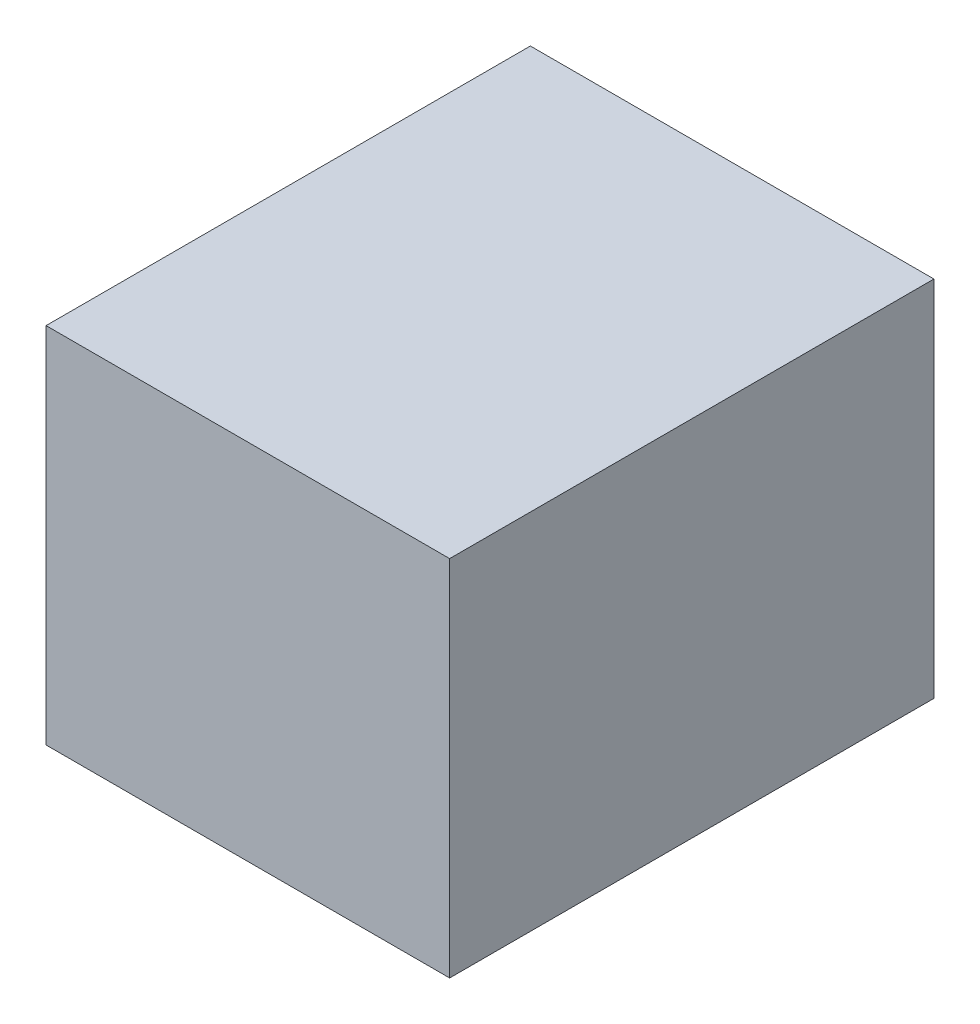
ISO-10303-21;
HEADER;
FILE_DESCRIPTION(('STEP AP214'),'2;1');
FILE_NAME('part.step','',(''),(''),'','','');
FILE_SCHEMA(('AUTOMOTIVE_DESIGN { 1 0 10303 214 1 1 1 1 }'));
ENDSEC;
DATA;
#1=APPLICATION_CONTEXT('core data for automotive mechanical design processes');
#2=APPLICATION_PROTOCOL_DEFINITION('international standard','automotive_design',2000,#1);
#3=PRODUCT_CONTEXT('',#1,'mechanical');
#4=PRODUCT('Part','Part','',(#3));
#5=PRODUCT_RELATED_PRODUCT_CATEGORY('part','',(#4));
#6=PRODUCT_DEFINITION_FORMATION('','',#4);
#7=PRODUCT_DEFINITION_CONTEXT('part definition',#1,'design');
#8=PRODUCT_DEFINITION('design','',#6,#7);
#9=PRODUCT_DEFINITION_SHAPE('','',#8);
#10=(LENGTH_UNIT() NAMED_UNIT(*) SI_UNIT(.MILLI.,.METRE.));
#11=(NAMED_UNIT(*) PLANE_ANGLE_UNIT() SI_UNIT($,.RADIAN.));
#12=(NAMED_UNIT(*) SI_UNIT($,.STERADIAN.) SOLID_ANGLE_UNIT());
#13=UNCERTAINTY_MEASURE_WITH_UNIT(LENGTH_MEASURE(1.E-05),#10,'distance_accuracy_value','');
#14=(GEOMETRIC_REPRESENTATION_CONTEXT(3) GLOBAL_UNCERTAINTY_ASSIGNED_CONTEXT((#13)) GLOBAL_UNIT_ASSIGNED_CONTEXT((#10,
#11,#12)) REPRESENTATION_CONTEXT('',''));
#15=CARTESIAN_POINT('',(0.,0.,0.));
#16=DIRECTION('',(0.,0.,1.));
#17=DIRECTION('',(1.,0.,0.));
#18=AXIS2_PLACEMENT_3D('',#15,#16,#17);
#19=CARTESIAN_POINT('',(0.,450.,0.));
#20=DIRECTION('',(1.,0.,0.));
#21=DIRECTION('',(0.,0.,-1.));
#22=AXIS2_PLACEMENT_3D('',#19,#20,#21);
#23=PLANE('',#22);
#24=DIRECTION('',(0.,0.,1.));
#25=VECTOR('',#24,1.);
#26=CARTESIAN_POINT('',(0.,225.,-575.));
#27=LINE('',#26,#25);
#28=CARTESIAN_POINT('',(0.,225.,-575.));
#29=VERTEX_POINT('',#28);
#30=CARTESIAN_POINT('',(0.,225.,-25.));
#31=VERTEX_POINT('',#30);
#32=EDGE_CURVE('E150',#29,#31,#27,.T.);
#33=ORIENTED_EDGE('',*,*,#32,.F.);
#34=DIRECTION('',(0.,-1.,0.));
#35=VECTOR('',#34,1.);
#36=CARTESIAN_POINT('',(0.,425.,-575.));
#37=LINE('',#36,#35);
#38=CARTESIAN_POINT('',(0.,425.,-575.));
#39=VERTEX_POINT('',#38);
#40=EDGE_CURVE('E58',#39,#29,#37,.T.);
#41=ORIENTED_EDGE('',*,*,#40,.F.);
#42=DIRECTION('',(0.,0.,1.));
#43=VECTOR('',#42,1.);
#44=CARTESIAN_POINT('',(0.,425.,-575.));
#45=LINE('',#44,#43);
#46=CARTESIAN_POINT('',(0.,425.,-25.));
#47=VERTEX_POINT('',#46);
#48=EDGE_CURVE('E157',#39,#47,#45,.T.);
#49=ORIENTED_EDGE('',*,*,#48,.T.);
#50=DIRECTION('',(0.,-1.,0.));
#51=VECTOR('',#50,1.);
#52=CARTESIAN_POINT('',(0.,425.,-25.));
#53=LINE('',#52,#51);
#54=EDGE_CURVE('E139',#47,#31,#53,.T.);
#55=ORIENTED_EDGE('',*,*,#54,.T.);
#56=EDGE_LOOP('',(#33,#41,#49,#55));
#57=FACE_BOUND('',#56,.T.);
#58=DIRECTION('',(0.,0.,1.));
#59=VECTOR('',#58,1.);
#60=CARTESIAN_POINT('',(0.,25.,-575.));
#61=LINE('',#60,#59);
#62=CARTESIAN_POINT('',(0.,25.,-575.));
#63=VERTEX_POINT('',#62);
#64=CARTESIAN_POINT('',(0.,25.,-25.));
#65=VERTEX_POINT('',#64);
#66=EDGE_CURVE('E201',#63,#65,#61,.T.);
#67=ORIENTED_EDGE('',*,*,#66,.F.);
#68=DIRECTION('',(0.,-1.,0.));
#69=VECTOR('',#68,1.);
#70=CARTESIAN_POINT('',(0.,200.,-575.));
#71=LINE('',#70,#69);
#72=CARTESIAN_POINT('',(0.,200.,-575.));
#73=VERTEX_POINT('',#72);
#74=EDGE_CURVE('E66',#73,#63,#71,.T.);
#75=ORIENTED_EDGE('',*,*,#74,.F.);
#76=DIRECTION('',(0.,0.,1.));
#77=VECTOR('',#76,1.);
#78=CARTESIAN_POINT('',(0.,200.,-575.));
#79=LINE('',#78,#77);
#80=CARTESIAN_POINT('',(0.,200.,-25.));
#81=VERTEX_POINT('',#80);
#82=EDGE_CURVE('E183',#73,#81,#79,.T.);
#83=ORIENTED_EDGE('',*,*,#82,.T.);
#84=DIRECTION('',(0.,-1.,0.));
#85=VECTOR('',#84,1.);
#86=CARTESIAN_POINT('',(0.,200.,-25.));
#87=LINE('',#86,#85);
#88=EDGE_CURVE('E197',#81,#65,#87,.T.);
#89=ORIENTED_EDGE('',*,*,#88,.T.);
#90=EDGE_LOOP('',(#67,#75,#83,#89));
#91=FACE_BOUND('',#90,.T.);
#92=DIRECTION('',(0.,0.,1.));
#93=VECTOR('',#92,1.);
#94=CARTESIAN_POINT('',(0.,0.,0.));
#95=LINE('',#94,#93);
#96=CARTESIAN_POINT('',(0.,0.,-600.));
#97=VERTEX_POINT('',#96);
#98=CARTESIAN_POINT('',(0.,0.,0.));
#99=VERTEX_POINT('',#98);
#100=EDGE_CURVE('E174',#97,#99,#95,.T.);
#101=ORIENTED_EDGE('',*,*,#100,.T.);
#102=DIRECTION('',(0.,-1.,0.));
#103=VECTOR('',#102,1.);
#104=CARTESIAN_POINT('',(0.,450.,0.));
#105=LINE('',#104,#103);
#106=CARTESIAN_POINT('',(0.,450.,0.));
#107=VERTEX_POINT('',#106);
#108=EDGE_CURVE('E12',#107,#99,#105,.T.);
#109=ORIENTED_EDGE('',*,*,#108,.F.);
#110=DIRECTION('',(0.,0.,1.));
#111=VECTOR('',#110,1.);
#112=CARTESIAN_POINT('',(0.,450.,0.));
#113=LINE('',#112,#111);
#114=CARTESIAN_POINT('',(0.,450.,-600.));
#115=VERTEX_POINT('',#114);
#116=EDGE_CURVE('E216',#115,#107,#113,.T.);
#117=ORIENTED_EDGE('',*,*,#116,.F.);
#118=DIRECTION('',(0.,-1.,0.));
#119=VECTOR('',#118,1.);
#120=CARTESIAN_POINT('',(0.,450.,-600.));
#121=LINE('',#120,#119);
#122=EDGE_CURVE('E230',#115,#97,#121,.T.);
#123=ORIENTED_EDGE('',*,*,#122,.T.);
#124=EDGE_LOOP('',(#101,#109,#117,#123));
#125=FACE_BOUND('',#124,.T.);
#126=ADVANCED_FACE('F43',(#57,#91,#125),#23,.F.);
#127=CARTESIAN_POINT('',(0.,450.,0.));
#128=DIRECTION('',(0.,0.,-1.));
#129=DIRECTION('',(-1.,0.,0.));
#130=AXIS2_PLACEMENT_3D('',#127,#128,#129);
#131=PLANE('',#130);
#132=DIRECTION('',(1.,0.,0.));
#133=VECTOR('',#132,1.);
#134=CARTESIAN_POINT('',(0.,0.,0.));
#135=LINE('',#134,#133);
#136=CARTESIAN_POINT('',(500.,0.,0.));
#137=VERTEX_POINT('',#136);
#138=EDGE_CURVE('E234',#99,#137,#135,.T.);
#139=ORIENTED_EDGE('',*,*,#138,.T.);
#140=DIRECTION('',(0.,-1.,0.));
#141=VECTOR('',#140,1.);
#142=CARTESIAN_POINT('',(500.,450.,0.));
#143=LINE('',#142,#141);
#144=CARTESIAN_POINT('',(500.,450.,0.));
#145=VERTEX_POINT('',#144);
#146=EDGE_CURVE('E51',#145,#137,#143,.T.);
#147=ORIENTED_EDGE('',*,*,#146,.F.);
#148=DIRECTION('',(1.,0.,0.));
#149=VECTOR('',#148,1.);
#150=CARTESIAN_POINT('',(0.,450.,0.));
#151=LINE('',#150,#149);
#152=EDGE_CURVE('E220',#107,#145,#151,.T.);
#153=ORIENTED_EDGE('',*,*,#152,.F.);
#154=ORIENTED_EDGE('',*,*,#108,.T.);
#155=EDGE_LOOP('',(#139,#147,#153,#154));
#156=FACE_BOUND('',#155,.T.);
#157=ADVANCED_FACE('F270',(#156),#131,.F.);
#158=CARTESIAN_POINT('',(500.,450.,0.));
#159=DIRECTION('',(-1.,0.,0.));
#160=DIRECTION('',(0.,0.,1.));
#161=AXIS2_PLACEMENT_3D('',#158,#159,#160);
#162=PLANE('',#161);
#163=DIRECTION('',(0.,0.,-1.));
#164=VECTOR('',#163,1.);
#165=CARTESIAN_POINT('',(500.,0.,0.));
#166=LINE('',#165,#164);
#167=CARTESIAN_POINT('',(500.,0.,-600.));
#168=VERTEX_POINT('',#167);
#169=EDGE_CURVE('E237',#137,#168,#166,.T.);
#170=ORIENTED_EDGE('',*,*,#169,.T.);
#171=DIRECTION('',(0.,-1.,0.));
#172=VECTOR('',#171,1.);
#173=CARTESIAN_POINT('',(500.,450.,-600.));
#174=LINE('',#173,#172);
#175=CARTESIAN_POINT('',(500.,450.,-600.));
#176=VERTEX_POINT('',#175);
#177=EDGE_CURVE('E245',#176,#168,#174,.T.);
#178=ORIENTED_EDGE('',*,*,#177,.F.);
#179=DIRECTION('',(0.,0.,-1.));
#180=VECTOR('',#179,1.);
#181=CARTESIAN_POINT('',(500.,450.,0.));
#182=LINE('',#181,#180);
#183=EDGE_CURVE('E224',#145,#176,#182,.T.);
#184=ORIENTED_EDGE('',*,*,#183,.F.);
#185=ORIENTED_EDGE('',*,*,#146,.T.);
#186=EDGE_LOOP('',(#170,#178,#184,#185));
#187=FACE_BOUND('',#186,.T.);
#188=ADVANCED_FACE('F254',(#187),#162,.F.);
#189=CARTESIAN_POINT('',(0.,450.,-600.));
#190=DIRECTION('',(0.,0.,1.));
#191=DIRECTION('',(1.,0.,0.));
#192=AXIS2_PLACEMENT_3D('',#189,#190,#191);
#193=PLANE('',#192);
#194=DIRECTION('',(-1.,0.,0.));
#195=VECTOR('',#194,1.);
#196=CARTESIAN_POINT('',(0.,0.,-600.));
#197=LINE('',#196,#195);
#198=EDGE_CURVE('E221',#168,#97,#197,.T.);
#199=ORIENTED_EDGE('',*,*,#198,.T.);
#200=ORIENTED_EDGE('',*,*,#122,.F.);
#201=DIRECTION('',(-1.,0.,0.));
#202=VECTOR('',#201,1.);
#203=CARTESIAN_POINT('',(0.,450.,-600.));
#204=LINE('',#203,#202);
#205=EDGE_CURVE('E227',#176,#115,#204,.T.);
#206=ORIENTED_EDGE('',*,*,#205,.F.);
#207=ORIENTED_EDGE('',*,*,#177,.T.);
#208=EDGE_LOOP('',(#199,#200,#206,#207));
#209=FACE_BOUND('',#208,.T.);
#210=ADVANCED_FACE('F263',(#209),#193,.F.);
#211=CARTESIAN_POINT('',(0.,450.,0.));
#212=DIRECTION('',(0.,-1.,0.));
#213=DIRECTION('',(0.,0.,-1.));
#214=AXIS2_PLACEMENT_3D('',#211,#212,#213);
#215=PLANE('',#214);
#216=ORIENTED_EDGE('',*,*,#116,.T.);
#217=ORIENTED_EDGE('',*,*,#152,.T.);
#218=ORIENTED_EDGE('',*,*,#183,.T.);
#219=ORIENTED_EDGE('',*,*,#205,.T.);
#220=EDGE_LOOP('',(#216,#217,#218,#219));
#221=FACE_BOUND('',#220,.T.);
#222=ADVANCED_FACE('F269',(#221),#215,.F.);
#223=CARTESIAN_POINT('',(0.,0.,0.));
#224=DIRECTION('',(0.,-1.,0.));
#225=DIRECTION('',(0.,0.,-1.));
#226=AXIS2_PLACEMENT_3D('',#223,#224,#225);
#227=PLANE('',#226);
#228=ORIENTED_EDGE('',*,*,#100,.F.);
#229=ORIENTED_EDGE('',*,*,#198,.F.);
#230=ORIENTED_EDGE('',*,*,#169,.F.);
#231=ORIENTED_EDGE('',*,*,#138,.F.);
#232=EDGE_LOOP('',(#228,#229,#230,#231));
#233=FACE_BOUND('',#232,.T.);
#234=ADVANCED_FACE('F260',(#233),#227,.T.);
#235=CARTESIAN_POINT('',(1085.23499553598,200.,-575.));
#236=DIRECTION('',(0.,0.,-1.));
#237=DIRECTION('',(-1.,0.,0.));
#238=AXIS2_PLACEMENT_3D('',#235,#236,#237);
#239=PLANE('',#238);
#240=DIRECTION('',(0.,1.,0.));
#241=VECTOR('',#240,1.);
#242=CARTESIAN_POINT('',(475.,200.,-575.));
#243=LINE('',#242,#241);
#244=CARTESIAN_POINT('',(475.,25.,-575.));
#245=VERTEX_POINT('',#244);
#246=CARTESIAN_POINT('',(475.,200.,-575.));
#247=VERTEX_POINT('',#246);
#248=EDGE_CURVE('E179',#245,#247,#243,.T.);
#249=ORIENTED_EDGE('',*,*,#248,.T.);
#250=DIRECTION('',(-1.,0.,0.));
#251=VECTOR('',#250,1.);
#252=CARTESIAN_POINT('',(1085.23499553598,200.,-575.));
#253=LINE('',#252,#251);
#254=EDGE_CURVE('E190',#247,#73,#253,.T.);
#255=ORIENTED_EDGE('',*,*,#254,.T.);
#256=ORIENTED_EDGE('',*,*,#74,.T.);
#257=DIRECTION('',(-1.,0.,0.));
#258=VECTOR('',#257,1.);
#259=CARTESIAN_POINT('',(1085.23499553598,25.,-575.));
#260=LINE('',#259,#258);
#261=EDGE_CURVE('E180',#245,#63,#260,.T.);
#262=ORIENTED_EDGE('',*,*,#261,.F.);
#263=EDGE_LOOP('',(#249,#255,#256,#262));
#264=FACE_BOUND('',#263,.T.);
#265=ADVANCED_FACE('F282',(#264),#239,.F.);
#266=CARTESIAN_POINT('',(1085.23499553598,200.,-575.));
#267=DIRECTION('',(0.,-1.,0.));
#268=DIRECTION('',(0.,0.,-1.));
#269=AXIS2_PLACEMENT_3D('',#266,#267,#268);
#270=PLANE('',#269);
#271=DIRECTION('',(-1.,0.,0.));
#272=VECTOR('',#271,1.);
#273=CARTESIAN_POINT('',(1085.23499553598,200.,-25.));
#274=LINE('',#273,#272);
#275=CARTESIAN_POINT('',(475.,200.,-25.));
#276=VERTEX_POINT('',#275);
#277=EDGE_CURVE('E187',#276,#81,#274,.T.);
#278=ORIENTED_EDGE('',*,*,#277,.T.);
#279=ORIENTED_EDGE('',*,*,#82,.F.);
#280=ORIENTED_EDGE('',*,*,#254,.F.);
#281=DIRECTION('',(0.,0.,-1.));
#282=VECTOR('',#281,1.);
#283=CARTESIAN_POINT('',(475.,200.,-575.));
#284=LINE('',#283,#282);
#285=EDGE_CURVE('E209',#276,#247,#284,.T.);
#286=ORIENTED_EDGE('',*,*,#285,.F.);
#287=EDGE_LOOP('',(#278,#279,#280,#286));
#288=FACE_BOUND('',#287,.T.);
#289=ADVANCED_FACE('F291',(#288),#270,.T.);
#290=CARTESIAN_POINT('',(1085.23499553598,200.,-25.));
#291=DIRECTION('',(0.,0.,-1.));
#292=DIRECTION('',(-1.,0.,0.));
#293=AXIS2_PLACEMENT_3D('',#290,#291,#292);
#294=PLANE('',#293);
#295=DIRECTION('',(-1.,0.,0.));
#296=VECTOR('',#295,1.);
#297=CARTESIAN_POINT('',(1085.23499553598,25.,-25.));
#298=LINE('',#297,#296);
#299=CARTESIAN_POINT('',(475.,25.,-25.));
#300=VERTEX_POINT('',#299);
#301=EDGE_CURVE('E184',#300,#65,#298,.T.);
#302=ORIENTED_EDGE('',*,*,#301,.T.);
#303=ORIENTED_EDGE('',*,*,#88,.F.);
#304=ORIENTED_EDGE('',*,*,#277,.F.);
#305=DIRECTION('',(0.,1.,0.));
#306=VECTOR('',#305,1.);
#307=CARTESIAN_POINT('',(475.,200.,-25.));
#308=LINE('',#307,#306);
#309=EDGE_CURVE('E193',#300,#276,#308,.T.);
#310=ORIENTED_EDGE('',*,*,#309,.F.);
#311=EDGE_LOOP('',(#302,#303,#304,#310));
#312=FACE_BOUND('',#311,.T.);
#313=ADVANCED_FACE('F294',(#312),#294,.T.);
#314=CARTESIAN_POINT('',(1085.23499553598,25.,-575.));
#315=DIRECTION('',(0.,-1.,0.));
#316=DIRECTION('',(0.,0.,-1.));
#317=AXIS2_PLACEMENT_3D('',#314,#315,#316);
#318=PLANE('',#317);
#319=DIRECTION('',(0.,0.,-1.));
#320=VECTOR('',#319,1.);
#321=CARTESIAN_POINT('',(475.,25.,-575.));
#322=LINE('',#321,#320);
#323=EDGE_CURVE('E176',#300,#245,#322,.T.);
#324=ORIENTED_EDGE('',*,*,#323,.T.);
#325=ORIENTED_EDGE('',*,*,#261,.T.);
#326=ORIENTED_EDGE('',*,*,#66,.T.);
#327=ORIENTED_EDGE('',*,*,#301,.F.);
#328=EDGE_LOOP('',(#324,#325,#326,#327));
#329=FACE_BOUND('',#328,.T.);
#330=ADVANCED_FACE('F289',(#329),#318,.F.);
#331=CARTESIAN_POINT('',(475.,450.,0.));
#332=DIRECTION('',(-1.,0.,0.));
#333=DIRECTION('',(0.,0.,1.));
#334=AXIS2_PLACEMENT_3D('',#331,#332,#333);
#335=PLANE('',#334);
#336=ORIENTED_EDGE('',*,*,#248,.F.);
#337=ORIENTED_EDGE('',*,*,#323,.F.);
#338=ORIENTED_EDGE('',*,*,#309,.T.);
#339=ORIENTED_EDGE('',*,*,#285,.T.);
#340=EDGE_LOOP('',(#336,#337,#338,#339));
#341=FACE_BOUND('',#340,.T.);
#342=ADVANCED_FACE('F285',(#341),#335,.T.);
#343=CARTESIAN_POINT('',(1085.23499553598,425.,-575.));
#344=DIRECTION('',(0.,0.,-1.));
#345=DIRECTION('',(-1.,0.,0.));
#346=AXIS2_PLACEMENT_3D('',#343,#344,#345);
#347=PLANE('',#346);
#348=DIRECTION('',(0.,1.,0.));
#349=VECTOR('',#348,1.);
#350=CARTESIAN_POINT('',(475.,425.,-575.));
#351=LINE('',#350,#349);
#352=CARTESIAN_POINT('',(475.,225.,-575.));
#353=VERTEX_POINT('',#352);
#354=CARTESIAN_POINT('',(475.,425.,-575.));
#355=VERTEX_POINT('',#354);
#356=EDGE_CURVE('E175',#353,#355,#351,.T.);
#357=ORIENTED_EDGE('',*,*,#356,.T.);
#358=DIRECTION('',(-1.,0.,0.));
#359=VECTOR('',#358,1.);
#360=CARTESIAN_POINT('',(1085.23499553598,425.,-575.));
#361=LINE('',#360,#359);
#362=EDGE_CURVE('E164',#355,#39,#361,.T.);
#363=ORIENTED_EDGE('',*,*,#362,.T.);
#364=ORIENTED_EDGE('',*,*,#40,.T.);
#365=DIRECTION('',(-1.,0.,0.));
#366=VECTOR('',#365,1.);
#367=CARTESIAN_POINT('',(1085.23499553598,225.,-575.));
#368=LINE('',#367,#366);
#369=EDGE_CURVE('E147',#353,#29,#368,.T.);
#370=ORIENTED_EDGE('',*,*,#369,.F.);
#371=EDGE_LOOP('',(#357,#363,#364,#370));
#372=FACE_BOUND('',#371,.T.);
#373=ADVANCED_FACE('F288',(#372),#347,.F.);
#374=CARTESIAN_POINT('',(1085.23499553598,425.,-575.));
#375=DIRECTION('',(0.,-1.,0.));
#376=DIRECTION('',(0.,0.,-1.));
#377=AXIS2_PLACEMENT_3D('',#374,#375,#376);
#378=PLANE('',#377);
#379=DIRECTION('',(-1.,0.,0.));
#380=VECTOR('',#379,1.);
#381=CARTESIAN_POINT('',(1085.23499553598,425.,-25.));
#382=LINE('',#381,#380);
#383=CARTESIAN_POINT('',(475.,425.,-25.));
#384=VERTEX_POINT('',#383);
#385=EDGE_CURVE('E146',#384,#47,#382,.T.);
#386=ORIENTED_EDGE('',*,*,#385,.T.);
#387=ORIENTED_EDGE('',*,*,#48,.F.);
#388=ORIENTED_EDGE('',*,*,#362,.F.);
#389=DIRECTION('',(0.,0.,-1.));
#390=VECTOR('',#389,1.);
#391=CARTESIAN_POINT('',(475.,425.,-575.));
#392=LINE('',#391,#390);
#393=EDGE_CURVE('E321',#384,#355,#392,.T.);
#394=ORIENTED_EDGE('',*,*,#393,.F.);
#395=EDGE_LOOP('',(#386,#387,#388,#394));
#396=FACE_BOUND('',#395,.T.);
#397=ADVANCED_FACE('F306',(#396),#378,.T.);
#398=CARTESIAN_POINT('',(1085.23499553598,425.,-25.));
#399=DIRECTION('',(0.,0.,-1.));
#400=DIRECTION('',(0.,1.,0.));
#401=AXIS2_PLACEMENT_3D('',#398,#399,#400);
#402=PLANE('',#401);
#403=DIRECTION('',(-1.,0.,0.));
#404=VECTOR('',#403,1.);
#405=CARTESIAN_POINT('',(1085.23499553598,225.,-25.));
#406=LINE('',#405,#404);
#407=CARTESIAN_POINT('',(475.,225.,-25.));
#408=VERTEX_POINT('',#407);
#409=EDGE_CURVE('E134',#408,#31,#406,.T.);
#410=ORIENTED_EDGE('',*,*,#409,.T.);
#411=ORIENTED_EDGE('',*,*,#54,.F.);
#412=ORIENTED_EDGE('',*,*,#385,.F.);
#413=DIRECTION('',(0.,1.,0.));
#414=VECTOR('',#413,1.);
#415=CARTESIAN_POINT('',(475.,425.,-25.));
#416=LINE('',#415,#414);
#417=EDGE_CURVE('E142',#408,#384,#416,.T.);
#418=ORIENTED_EDGE('',*,*,#417,.F.);
#419=EDGE_LOOP('',(#410,#411,#412,#418));
#420=FACE_BOUND('',#419,.T.);
#421=ADVANCED_FACE('F136',(#420),#402,.T.);
#422=CARTESIAN_POINT('',(1085.23499553598,225.,-575.));
#423=DIRECTION('',(0.,-1.,0.));
#424=DIRECTION('',(0.,0.,-1.));
#425=AXIS2_PLACEMENT_3D('',#422,#423,#424);
#426=PLANE('',#425);
#427=DIRECTION('',(0.,0.,-1.));
#428=VECTOR('',#427,1.);
#429=CARTESIAN_POINT('',(475.,225.,-575.));
#430=LINE('',#429,#428);
#431=EDGE_CURVE('E171',#408,#353,#430,.T.);
#432=ORIENTED_EDGE('',*,*,#431,.T.);
#433=ORIENTED_EDGE('',*,*,#369,.T.);
#434=ORIENTED_EDGE('',*,*,#32,.T.);
#435=ORIENTED_EDGE('',*,*,#409,.F.);
#436=EDGE_LOOP('',(#432,#433,#434,#435));
#437=FACE_BOUND('',#436,.T.);
#438=ADVANCED_FACE('F151',(#437),#426,.F.);
#439=CARTESIAN_POINT('',(475.,450.,0.));
#440=DIRECTION('',(-1.,0.,0.));
#441=DIRECTION('',(0.,0.,1.));
#442=AXIS2_PLACEMENT_3D('',#439,#440,#441);
#443=PLANE('',#442);
#444=ORIENTED_EDGE('',*,*,#356,.F.);
#445=ORIENTED_EDGE('',*,*,#431,.F.);
#446=ORIENTED_EDGE('',*,*,#417,.T.);
#447=ORIENTED_EDGE('',*,*,#393,.T.);
#448=EDGE_LOOP('',(#444,#445,#446,#447));
#449=FACE_BOUND('',#448,.T.);
#450=ADVANCED_FACE('F309',(#449),#443,.T.);
#451=CLOSED_SHELL('',(#126,#157,#188,#210,#222,#234,#265,#289,#313,#330,#342,#373,#397,#421,
#438,#450));
#452=MANIFOLD_SOLID_BREP('B2',#451);
#453=ADVANCED_BREP_SHAPE_REPRESENTATION('',(#18,#452),#14);
#454=SHAPE_DEFINITION_REPRESENTATION(#9,#453);
ENDSEC;
END-ISO-10303-21;
